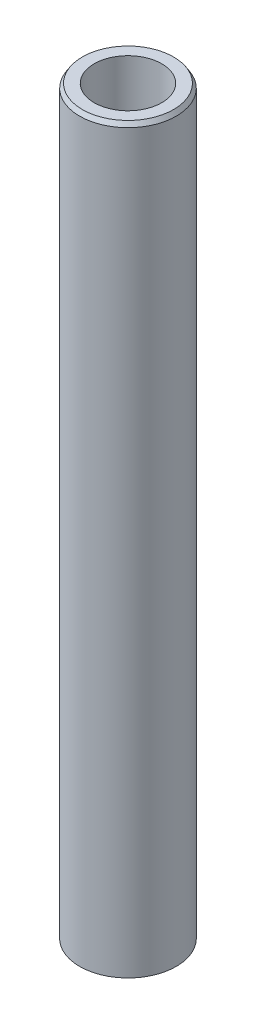
ISO-10303-21;
HEADER;
FILE_DESCRIPTION(('STEP AP214'),'2;1');
FILE_NAME('part.step','',(''),(''),'','','');
FILE_SCHEMA(('AUTOMOTIVE_DESIGN { 1 0 10303 214 1 1 1 1 }'));
ENDSEC;
DATA;
#1=APPLICATION_CONTEXT('core data for automotive mechanical design processes');
#2=APPLICATION_PROTOCOL_DEFINITION('international standard','automotive_design',2000,#1);
#3=PRODUCT_CONTEXT('',#1,'mechanical');
#4=PRODUCT('Part','Part','',(#3));
#5=PRODUCT_RELATED_PRODUCT_CATEGORY('part','',(#4));
#6=PRODUCT_DEFINITION_FORMATION('','',#4);
#7=PRODUCT_DEFINITION_CONTEXT('part definition',#1,'design');
#8=PRODUCT_DEFINITION('design','',#6,#7);
#9=PRODUCT_DEFINITION_SHAPE('','',#8);
#10=(LENGTH_UNIT() NAMED_UNIT(*) SI_UNIT(.MILLI.,.METRE.));
#11=(NAMED_UNIT(*) PLANE_ANGLE_UNIT() SI_UNIT($,.RADIAN.));
#12=(NAMED_UNIT(*) SI_UNIT($,.STERADIAN.) SOLID_ANGLE_UNIT());
#13=UNCERTAINTY_MEASURE_WITH_UNIT(LENGTH_MEASURE(1.E-05),#10,'distance_accuracy_value','');
#14=(GEOMETRIC_REPRESENTATION_CONTEXT(3) GLOBAL_UNCERTAINTY_ASSIGNED_CONTEXT((#13)) GLOBAL_UNIT_ASSIGNED_CONTEXT((#10,
#11,#12)) REPRESENTATION_CONTEXT('',''));
#15=CARTESIAN_POINT('',(0.,0.,0.));
#16=DIRECTION('',(0.,0.,1.));
#17=DIRECTION('',(1.,0.,0.));
#18=AXIS2_PLACEMENT_3D('',#15,#16,#17);
#19=CARTESIAN_POINT('',(0.,384.552550562603,0.));
#20=DIRECTION('',(0.,-1.,0.));
#21=DIRECTION('',(0.,0.,-1.));
#22=AXIS2_PLACEMENT_3D('',#19,#20,#21);
#23=CYLINDRICAL_SURFACE('',#22,25.);
#24=CARTESIAN_POINT('',(0.,382.305094317185,0.));
#25=DIRECTION('',(0.,1.,0.));
#26=DIRECTION('',(0.,0.,1.));
#27=AXIS2_PLACEMENT_3D('',#24,#25,#26);
#28=CIRCLE('',#27,25.);
#29=CARTESIAN_POINT('',(0.,382.305094317185,25.));
#30=VERTEX_POINT('',#29);
#31=EDGE_CURVE('E50',#30,#30,#28,.F.);
#32=ORIENTED_EDGE('',*,*,#31,.T.);
#33=EDGE_LOOP('',(#32));
#34=FACE_BOUND('',#33,.T.);
#35=CARTESIAN_POINT('',(0.,1.41085518672596,0.));
#36=DIRECTION('',(0.,1.,0.));
#37=DIRECTION('',(0.,0.,1.));
#38=AXIS2_PLACEMENT_3D('',#35,#36,#37);
#39=CIRCLE('',#38,25.);
#40=CARTESIAN_POINT('',(0.,1.41085518672596,25.));
#41=VERTEX_POINT('',#40);
#42=EDGE_CURVE('E51',#41,#41,#39,.T.);
#43=ORIENTED_EDGE('',*,*,#42,.T.);
#44=EDGE_LOOP('',(#43));
#45=FACE_BOUND('',#44,.T.);
#46=ADVANCED_FACE('F39',(#34,#45),#23,.T.);
#47=CARTESIAN_POINT('',(0.,384.552550562603,0.));
#48=DIRECTION('',(0.,1.,0.));
#49=DIRECTION('',(0.,0.,1.));
#50=AXIS2_PLACEMENT_3D('',#47,#48,#49);
#51=PLANE('',#50);
#52=CARTESIAN_POINT('',(0.,384.552550562603,0.));
#53=DIRECTION('',(0.,1.,0.));
#54=DIRECTION('',(0.,0.,1.));
#55=AXIS2_PLACEMENT_3D('',#52,#53,#54);
#56=CIRCLE('',#55,23.589144813274);
#57=CARTESIAN_POINT('',(0.,384.552550562603,23.589144813274));
#58=VERTEX_POINT('',#57);
#59=EDGE_CURVE('E54',#58,#58,#56,.T.);
#60=ORIENTED_EDGE('',*,*,#59,.T.);
#61=EDGE_LOOP('',(#60));
#62=FACE_BOUND('',#61,.T.);
#63=CARTESIAN_POINT('',(0.,384.552550562603,0.));
#64=DIRECTION('',(0.,1.,0.));
#65=DIRECTION('',(0.,0.,1.));
#66=AXIS2_PLACEMENT_3D('',#63,#64,#65);
#67=CIRCLE('',#66,17.4735873601439);
#68=CARTESIAN_POINT('',(0.,384.552550562603,17.4735873601439));
#69=VERTEX_POINT('',#68);
#70=EDGE_CURVE('E58',#69,#69,#67,.T.);
#71=ORIENTED_EDGE('',*,*,#70,.F.);
#72=EDGE_LOOP('',(#71));
#73=FACE_BOUND('',#72,.T.);
#74=ADVANCED_FACE('F69',(#62,#73),#51,.T.);
#75=CARTESIAN_POINT('',(0.,0.,0.));
#76=DIRECTION('',(0.,1.,0.));
#77=DIRECTION('',(0.,0.,1.));
#78=AXIS2_PLACEMENT_3D('',#75,#76,#77);
#79=PLANE('',#78);
#80=CARTESIAN_POINT('',(0.,0.,0.));
#81=DIRECTION('',(0.,1.,0.));
#82=DIRECTION('',(0.,0.,1.));
#83=AXIS2_PLACEMENT_3D('',#80,#81,#82);
#84=CIRCLE('',#83,22.7525437545822);
#85=CARTESIAN_POINT('',(0.,0.,22.7525437545822));
#86=VERTEX_POINT('',#85);
#87=EDGE_CURVE('E10',#86,#86,#84,.F.);
#88=ORIENTED_EDGE('',*,*,#87,.T.);
#89=EDGE_LOOP('',(#88));
#90=FACE_BOUND('',#89,.T.);
#91=CARTESIAN_POINT('',(0.,0.,0.));
#92=DIRECTION('',(0.,1.,0.));
#93=DIRECTION('',(0.,0.,1.));
#94=AXIS2_PLACEMENT_3D('',#91,#92,#93);
#95=CIRCLE('',#94,17.4735873601439);
#96=CARTESIAN_POINT('',(0.,0.,17.4735873601439));
#97=VERTEX_POINT('',#96);
#98=EDGE_CURVE('E63',#97,#97,#95,.T.);
#99=ORIENTED_EDGE('',*,*,#98,.T.);
#100=EDGE_LOOP('',(#99));
#101=FACE_BOUND('',#100,.T.);
#102=ADVANCED_FACE('F75',(#90,#101),#79,.F.);
#103=CARTESIAN_POINT('',(0.,384.552550562603,0.));
#104=DIRECTION('',(0.,-1.,0.));
#105=DIRECTION('',(0.,0.,-1.));
#106=AXIS2_PLACEMENT_3D('',#103,#104,#105);
#107=CYLINDRICAL_SURFACE('',#106,17.4735873601439);
#108=ORIENTED_EDGE('',*,*,#70,.T.);
#109=EDGE_LOOP('',(#108));
#110=FACE_BOUND('',#109,.T.);
#111=ORIENTED_EDGE('',*,*,#98,.F.);
#112=EDGE_LOOP('',(#111));
#113=FACE_BOUND('',#112,.T.);
#114=ADVANCED_FACE('F70',(#110,#113),#107,.F.);
#115=CARTESIAN_POINT('',(0.,384.552550562603,0.));
#116=DIRECTION('',(0.,-1.,0.));
#117=DIRECTION('',(0.,0.,-1.));
#118=AXIS2_PLACEMENT_3D('',#115,#116,#117);
#119=CONICAL_SURFACE('',#118,23.589144813274,0.560579036869266);
#120=ORIENTED_EDGE('',*,*,#31,.F.);
#121=EDGE_LOOP('',(#120));
#122=FACE_BOUND('',#121,.T.);
#123=ORIENTED_EDGE('',*,*,#59,.F.);
#124=EDGE_LOOP('',(#123));
#125=FACE_BOUND('',#124,.T.);
#126=ADVANCED_FACE('F81',(#122,#125),#119,.T.);
#127=CARTESIAN_POINT('',(0.,1.41085518672596,0.));
#128=DIRECTION('',(0.,1.,0.));
#129=DIRECTION('',(0.,0.,1.));
#130=AXIS2_PLACEMENT_3D('',#127,#128,#129);
#131=CONICAL_SURFACE('',#130,25.,1.01021728992562);
#132=CARTESIAN_POINT('',(0.,0.,22.7525437545822));
#133=CARTESIAN_POINT('',(0.,0.0146964081950615,22.7759547571386));
#134=CARTESIAN_POINT('',(0.,0.0293928163901237,22.7993657596951));
#135=CARTESIAN_POINT('',(0.,0.0587856327802481,22.8461877648079));
#136=CARTESIAN_POINT('',(0.,0.0734820409753104,22.8695987673644));
#137=CARTESIAN_POINT('',(0.,0.102874857365434,22.9164207724772));
#138=CARTESIAN_POINT('',(0.,0.117571265560496,22.9398317750337));
#139=CARTESIAN_POINT('',(0.,0.14696408195062,22.9866537801465));
#140=CARTESIAN_POINT('',(0.,0.161660490145682,23.010064782703));
#141=CARTESIAN_POINT('',(0.,0.191053306535807,23.0568867878158));
#142=CARTESIAN_POINT('',(0.,0.205749714730869,23.0802977903723));
#143=CARTESIAN_POINT('',(0.,0.235142531120993,23.1271197954852));
#144=CARTESIAN_POINT('',(0.,0.249838939316054,23.1505307980416));
#145=CARTESIAN_POINT('',(0.,0.279231755706178,23.1973528031545));
#146=CARTESIAN_POINT('',(0.,0.293928163901241,23.2207638057109));
#147=CARTESIAN_POINT('',(0.,0.323320980291365,23.2675858108238));
#148=CARTESIAN_POINT('',(0.,0.338017388486427,23.2909968133802));
#149=CARTESIAN_POINT('',(0.,0.367410204876551,23.3378188184931));
#150=CARTESIAN_POINT('',(0.,0.382106613071613,23.3612298210495));
#151=CARTESIAN_POINT('',(0.,0.411499429461737,23.4080518261624));
#152=CARTESIAN_POINT('',(0.,0.426195837656799,23.4314628287188));
#153=CARTESIAN_POINT('',(0.,0.455588654046924,23.4782848338317));
#154=CARTESIAN_POINT('',(0.,0.470285062241986,23.5016958363881));
#155=CARTESIAN_POINT('',(0.,0.49967787863211,23.548517841501));
#156=CARTESIAN_POINT('',(0.,0.514374286827171,23.5719288440574));
#157=CARTESIAN_POINT('',(0.,0.543767103217295,23.6187508491703));
#158=CARTESIAN_POINT('',(0.,0.558463511412358,23.6421618517267));
#159=CARTESIAN_POINT('',(0.,0.587856327802482,23.6889838568396));
#160=CARTESIAN_POINT('',(0.,0.602552735997544,23.712394859396));
#161=CARTESIAN_POINT('',(0.,0.631945552387668,23.7592168645089));
#162=CARTESIAN_POINT('',(0.,0.64664196058273,23.7826278670654));
#163=CARTESIAN_POINT('',(0.,0.676034776972854,23.8294498721782));
#164=CARTESIAN_POINT('',(0.,0.690731185167916,23.8528608747347));
#165=CARTESIAN_POINT('',(0.,0.72012400155804,23.8996828798475));
#166=CARTESIAN_POINT('',(0.,0.734820409753103,23.923093882404));
#167=CARTESIAN_POINT('',(0.,0.764213226143227,23.9699158875168));
#168=CARTESIAN_POINT('',(0.,0.778909634338288,23.9933268900733));
#169=CARTESIAN_POINT('',(0.,0.808302450728412,24.0401488951861));
#170=CARTESIAN_POINT('',(0.,0.822998858923475,24.0635598977426));
#171=CARTESIAN_POINT('',(0.,0.852391675313599,24.1103819028555));
#172=CARTESIAN_POINT('',(0.,0.867088083508661,24.1337929054119));
#173=CARTESIAN_POINT('',(0.,0.896480899898785,24.1806149105248));
#174=CARTESIAN_POINT('',(0.,0.911177308093847,24.2040259130812));
#175=CARTESIAN_POINT('',(0.,0.940570124483971,24.2508479181941));
#176=CARTESIAN_POINT('',(0.,0.955266532679033,24.2742589207505));
#177=CARTESIAN_POINT('',(0.,0.984659349069157,24.3210809258634));
#178=CARTESIAN_POINT('',(0.,0.999355757264219,24.3444919284198));
#179=CARTESIAN_POINT('',(0.,1.02874857365434,24.3913139335327));
#180=CARTESIAN_POINT('',(0.,1.04344498184941,24.4147249360891));
#181=CARTESIAN_POINT('',(0.,1.07283779823953,24.461546941202));
#182=CARTESIAN_POINT('',(0.,1.08753420643459,24.4849579437584));
#183=CARTESIAN_POINT('',(0.,1.11692702282472,24.5317799488713));
#184=CARTESIAN_POINT('',(0.,1.13162343101978,24.5551909514277));
#185=CARTESIAN_POINT('',(0.,1.1610162474099,24.6020129565406));
#186=CARTESIAN_POINT('',(0.,1.17571265560496,24.625423959097));
#187=CARTESIAN_POINT('',(0.,1.20510547199509,24.6722459642099));
#188=CARTESIAN_POINT('',(0.,1.21980188019015,24.6956569667663));
#189=CARTESIAN_POINT('',(0.,1.24919469658027,24.7424789718792));
#190=CARTESIAN_POINT('',(0.,1.26389110477534,24.7658899744356));
#191=CARTESIAN_POINT('',(0.,1.29328392116546,24.8127119795485));
#192=CARTESIAN_POINT('',(0.,1.30798032936052,24.8361229821049));
#193=CARTESIAN_POINT('',(0.,1.33737314575065,24.8829449872178));
#194=CARTESIAN_POINT('',(0.,1.35206955394571,24.9063559897743));
#195=CARTESIAN_POINT('',(0.,1.38146237033583,24.9531779948871));
#196=CARTESIAN_POINT('',(0.,1.39615877853089,24.9765889974436));
#197=CARTESIAN_POINT('',(0.,1.41085518672596,25.));
#198=B_SPLINE_CURVE_WITH_KNOTS('',3,(#132,#133,#134,#135,#136,#137,#138,#139,#140,#141,#142,
#143,#144,#145,#146,#147,#148,#149,#150,#151,#152,#153,#154,#155,#156,#157,#158,#159,#160,#161,
#162,#163,#164,#165,#166,#167,#168,#169,#170,#171,#172,#173,#174,#175,#176,#177,#178,#179,#180,
#181,#182,#183,#184,#185,#186,#187,#188,#189,#190,#191,#192,#193,#194,#195,#196,#197),
.UNSPECIFIED.,.F.,.F.,(4,2,2,2,2,2,2,2,2,2,2,2,2,2,2,2,2,2,2,2,2,2,2,2,2,2,2,2,2,2,2,2,4),(0.,
0.0829248761880277,0.165849752376055,0.248774628564086,0.331699504752114,0.414624380940141,
0.497549257128172,0.5804741333162,0.663399009504227,0.746323885692258,0.829248761880286,
0.912173638068313,0.995098514256344,1.07802339044437,1.1609482666324,1.24387314282043,
1.32679801900846,1.40972289519648,1.49264777138452,1.57557264757254,1.65849752376057,
1.7414223999486,1.82434727613663,1.90727215232466,1.99019702851269,2.07312190470071,
2.15604678088874,2.23897165707677,2.3218965332648,2.40482140945283,2.48774628564086,
2.57067116182889,2.65359603801691),.UNSPECIFIED.);
#199=EDGE_CURVE('BSEAM45',#86,#41,#198,.T.);
#200=ORIENTED_EDGE('',*,*,#87,.F.);
#201=ORIENTED_EDGE('',*,*,#42,.F.);
#202=ORIENTED_EDGE('',*,*,#199,.T.);
#203=ORIENTED_EDGE('',*,*,#199,.F.);
#204=EDGE_LOOP('',(#200,#202,#201,#203));
#205=FACE_BOUND('',#204,.T.);
#206=ADVANCED_FACE('F45',(#205),#131,.T.);
#207=CLOSED_SHELL('',(#46,#74,#102,#114,#126,#206));
#208=MANIFOLD_SOLID_BREP('B2',#207);
#209=ADVANCED_BREP_SHAPE_REPRESENTATION('',(#18,#208),#14);
#210=SHAPE_DEFINITION_REPRESENTATION(#9,#209);
ENDSEC;
END-ISO-10303-21;
